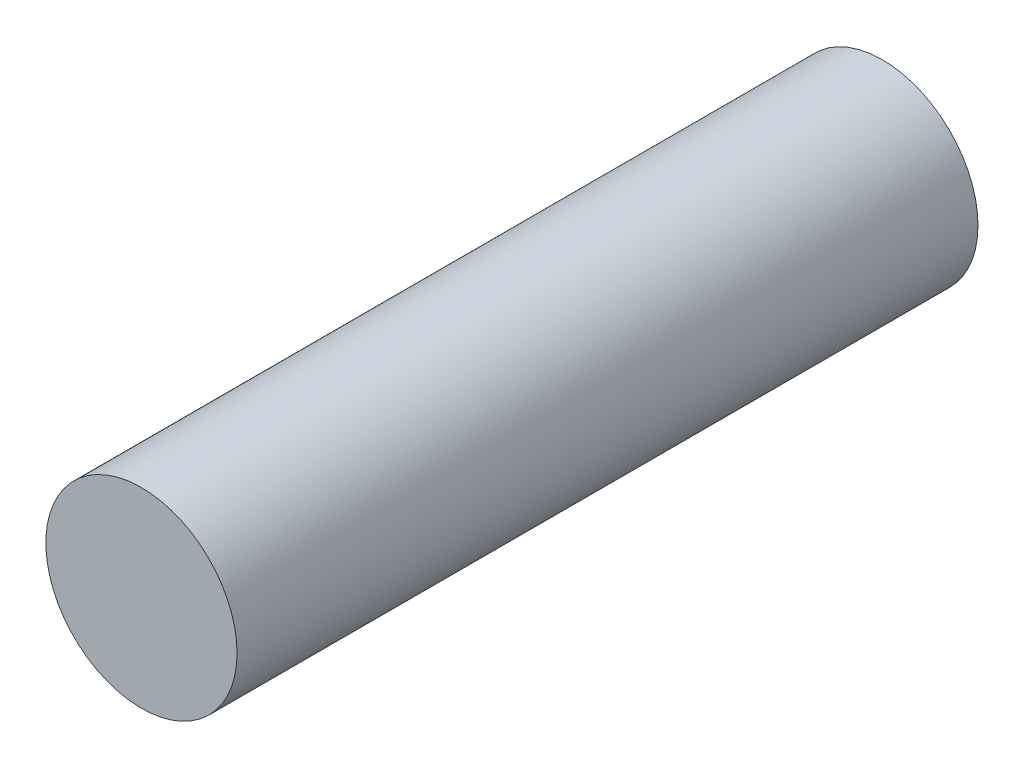
ISO-10303-21;
HEADER;
FILE_DESCRIPTION(('STEP AP214'),'2;1');
FILE_NAME('part.step','',(''),(''),'','','');
FILE_SCHEMA(('AUTOMOTIVE_DESIGN { 1 0 10303 214 1 1 1 1 }'));
ENDSEC;
DATA;
#1=APPLICATION_CONTEXT('core data for automotive mechanical design processes');
#2=APPLICATION_PROTOCOL_DEFINITION('international standard','automotive_design',2000,#1);
#3=PRODUCT_CONTEXT('',#1,'mechanical');
#4=PRODUCT('Part','Part','',(#3));
#5=PRODUCT_RELATED_PRODUCT_CATEGORY('part','',(#4));
#6=PRODUCT_DEFINITION_FORMATION('','',#4);
#7=PRODUCT_DEFINITION_CONTEXT('part definition',#1,'design');
#8=PRODUCT_DEFINITION('design','',#6,#7);
#9=PRODUCT_DEFINITION_SHAPE('','',#8);
#10=(LENGTH_UNIT() NAMED_UNIT(*) SI_UNIT(.MILLI.,.METRE.));
#11=(NAMED_UNIT(*) PLANE_ANGLE_UNIT() SI_UNIT($,.RADIAN.));
#12=(NAMED_UNIT(*) SI_UNIT($,.STERADIAN.) SOLID_ANGLE_UNIT());
#13=UNCERTAINTY_MEASURE_WITH_UNIT(LENGTH_MEASURE(1.E-05),#10,'distance_accuracy_value','');
#14=(GEOMETRIC_REPRESENTATION_CONTEXT(3) GLOBAL_UNCERTAINTY_ASSIGNED_CONTEXT((#13)) GLOBAL_UNIT_ASSIGNED_CONTEXT((#10,
#11,#12)) REPRESENTATION_CONTEXT('',''));
#15=CARTESIAN_POINT('',(0.,0.,0.));
#16=DIRECTION('',(0.,0.,1.));
#17=DIRECTION('',(1.,0.,0.));
#18=AXIS2_PLACEMENT_3D('',#15,#16,#17);
#19=CARTESIAN_POINT('',(-66.2494665346752,32.8842902711324,62.));
#20=DIRECTION('',(0.,0.,-1.));
#21=DIRECTION('',(-1.,0.,0.));
#22=AXIS2_PLACEMENT_3D('',#19,#20,#21);
#23=CYLINDRICAL_SURFACE('',#22,8.);
#24=CARTESIAN_POINT('',(-66.2494665346752,32.8842902711324,62.));
#25=DIRECTION('',(0.,0.,1.));
#26=DIRECTION('',(1.,0.,0.));
#27=AXIS2_PLACEMENT_3D('',#24,#25,#26);
#28=CIRCLE('',#27,8.);
#29=CARTESIAN_POINT('',(-58.2494665346753,32.8842902711324,62.));
#30=VERTEX_POINT('',#29);
#31=EDGE_CURVE('E10',#30,#30,#28,.T.);
#32=ORIENTED_EDGE('',*,*,#31,.F.);
#33=EDGE_LOOP('',(#32));
#34=FACE_BOUND('',#33,.T.);
#35=CARTESIAN_POINT('',(-66.2494665346752,32.8842902711324,0.));
#36=DIRECTION('',(0.,0.,1.));
#37=DIRECTION('',(1.,0.,0.));
#38=AXIS2_PLACEMENT_3D('',#35,#36,#37);
#39=CIRCLE('',#38,8.);
#40=CARTESIAN_POINT('',(-58.2494665346753,32.8842902711324,0.));
#41=VERTEX_POINT('',#40);
#42=EDGE_CURVE('E34',#41,#41,#39,.T.);
#43=ORIENTED_EDGE('',*,*,#42,.T.);
#44=EDGE_LOOP('',(#43));
#45=FACE_BOUND('',#44,.T.);
#46=ADVANCED_FACE('F31',(#34,#45),#23,.T.);
#47=CARTESIAN_POINT('',(-66.2494665346752,32.8842902711324,62.));
#48=DIRECTION('',(0.,0.,1.));
#49=DIRECTION('',(1.,0.,0.));
#50=AXIS2_PLACEMENT_3D('',#47,#48,#49);
#51=PLANE('',#50);
#52=ORIENTED_EDGE('',*,*,#31,.T.);
#53=EDGE_LOOP('',(#52));
#54=FACE_BOUND('',#53,.T.);
#55=ADVANCED_FACE('F46',(#54),#51,.T.);
#56=CARTESIAN_POINT('',(-66.2494665346752,32.8842902711324,0.));
#57=DIRECTION('',(0.,0.,1.));
#58=DIRECTION('',(1.,0.,0.));
#59=AXIS2_PLACEMENT_3D('',#56,#57,#58);
#60=PLANE('',#59);
#61=ORIENTED_EDGE('',*,*,#42,.F.);
#62=EDGE_LOOP('',(#61));
#63=FACE_BOUND('',#62,.T.);
#64=ADVANCED_FACE('F44',(#63),#60,.F.);
#65=CLOSED_SHELL('',(#46,#55,#64));
#66=MANIFOLD_SOLID_BREP('B2',#65);
#67=ADVANCED_BREP_SHAPE_REPRESENTATION('',(#18,#66),#14);
#68=SHAPE_DEFINITION_REPRESENTATION(#9,#67);
ENDSEC;
END-ISO-10303-21;
